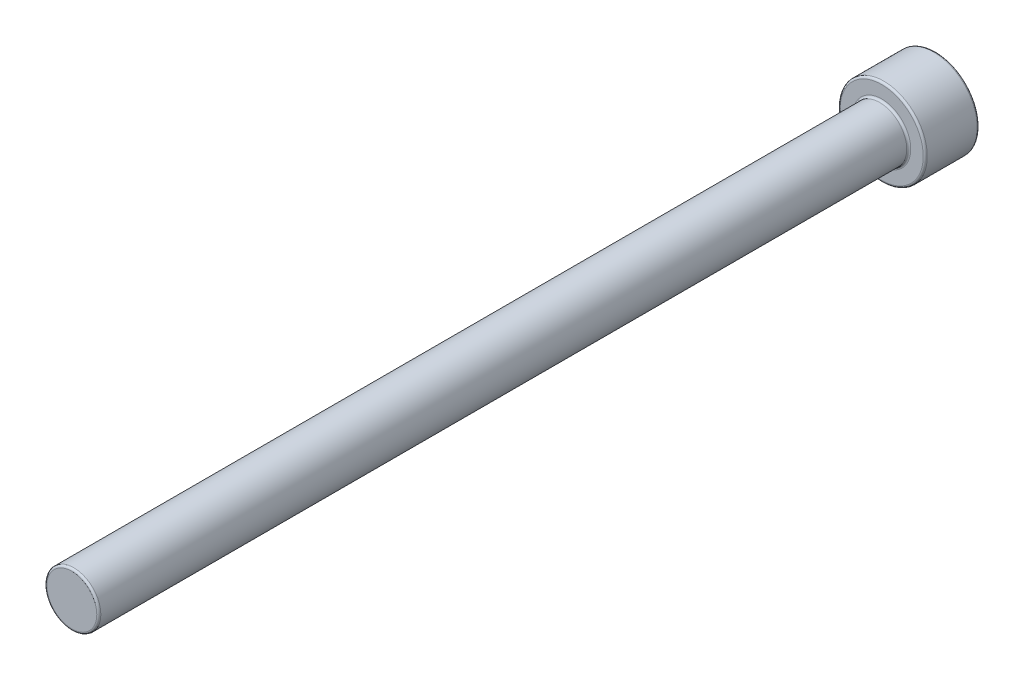
ISO-10303-21;
HEADER;
FILE_DESCRIPTION(('STEP AP214'),'2;1');
FILE_NAME('part.step','',(''),(''),'','','');
FILE_SCHEMA(('AUTOMOTIVE_DESIGN { 1 0 10303 214 1 1 1 1 }'));
ENDSEC;
DATA;
#1=APPLICATION_CONTEXT('core data for automotive mechanical design processes');
#2=APPLICATION_PROTOCOL_DEFINITION('international standard','automotive_design',2000,#1);
#3=PRODUCT_CONTEXT('',#1,'mechanical');
#4=PRODUCT('Part','Part','',(#3));
#5=PRODUCT_RELATED_PRODUCT_CATEGORY('part','',(#4));
#6=PRODUCT_DEFINITION_FORMATION('','',#4);
#7=PRODUCT_DEFINITION_CONTEXT('part definition',#1,'design');
#8=PRODUCT_DEFINITION('design','',#6,#7);
#9=PRODUCT_DEFINITION_SHAPE('','',#8);
#10=(LENGTH_UNIT() NAMED_UNIT(*) SI_UNIT(.MILLI.,.METRE.));
#11=(NAMED_UNIT(*) PLANE_ANGLE_UNIT() SI_UNIT($,.RADIAN.));
#12=(NAMED_UNIT(*) SI_UNIT($,.STERADIAN.) SOLID_ANGLE_UNIT());
#13=UNCERTAINTY_MEASURE_WITH_UNIT(LENGTH_MEASURE(1.E-05),#10,'distance_accuracy_value','');
#14=(GEOMETRIC_REPRESENTATION_CONTEXT(3) GLOBAL_UNCERTAINTY_ASSIGNED_CONTEXT((#13)) GLOBAL_UNIT_ASSIGNED_CONTEXT((#10,
#11,#12)) REPRESENTATION_CONTEXT('',''));
#15=CARTESIAN_POINT('',(0.,0.,0.));
#16=DIRECTION('',(0.,0.,1.));
#17=DIRECTION('',(1.,0.,0.));
#18=AXIS2_PLACEMENT_3D('',#15,#16,#17);
#19=CARTESIAN_POINT('',(0.,0.,120.));
#20=DIRECTION('',(0.,0.,-1.));
#21=DIRECTION('',(-1.,0.,0.));
#22=AXIS2_PLACEMENT_3D('',#19,#20,#21);
#23=CYLINDRICAL_SURFACE('',#22,4.);
#24=CARTESIAN_POINT('',(0.,0.,119.7));
#25=DIRECTION('',(0.,0.,1.));
#26=DIRECTION('',(1.,0.,0.));
#27=AXIS2_PLACEMENT_3D('',#24,#25,#26);
#28=CIRCLE('',#27,4.);
#29=CARTESIAN_POINT('',(4.,0.,119.7));
#30=VERTEX_POINT('',#29);
#31=EDGE_CURVE('E250',#30,#30,#28,.F.);
#32=ORIENTED_EDGE('',*,*,#31,.T.);
#33=EDGE_LOOP('',(#32));
#34=FACE_BOUND('',#33,.T.);
#35=CARTESIAN_POINT('',(0.,0.,0.299999999999995));
#36=DIRECTION('',(0.,0.,-1.));
#37=DIRECTION('',(-1.,0.,0.));
#38=AXIS2_PLACEMENT_3D('',#35,#36,#37);
#39=CIRCLE('',#38,4.);
#40=CARTESIAN_POINT('',(-4.,0.,0.299999999999995));
#41=VERTEX_POINT('',#40);
#42=EDGE_CURVE('E246',#41,#41,#39,.F.);
#43=ORIENTED_EDGE('',*,*,#42,.T.);
#44=EDGE_LOOP('',(#43));
#45=FACE_BOUND('',#44,.T.);
#46=ADVANCED_FACE('F35',(#34,#45),#23,.T.);
#47=CARTESIAN_POINT('',(0.,0.,120.));
#48=DIRECTION('',(0.,0.,1.));
#49=DIRECTION('',(1.,0.,0.));
#50=AXIS2_PLACEMENT_3D('',#47,#48,#49);
#51=PLANE('',#50);
#52=CARTESIAN_POINT('',(0.,0.,120.));
#53=DIRECTION('',(0.,0.,1.));
#54=DIRECTION('',(1.,0.,0.));
#55=AXIS2_PLACEMENT_3D('',#52,#53,#54);
#56=CIRCLE('',#55,3.7);
#57=CARTESIAN_POINT('',(3.7,0.,120.));
#58=VERTEX_POINT('',#57);
#59=EDGE_CURVE('E243',#58,#58,#56,.T.);
#60=ORIENTED_EDGE('',*,*,#59,.T.);
#61=EDGE_LOOP('',(#60));
#62=FACE_BOUND('',#61,.T.);
#63=ADVANCED_FACE('F325',(#62),#51,.T.);
#64=CARTESIAN_POINT('',(0.,0.,-8.));
#65=DIRECTION('',(0.,0.,1.));
#66=DIRECTION('',(1.,0.,0.));
#67=AXIS2_PLACEMENT_3D('',#64,#65,#66);
#68=CYLINDRICAL_SURFACE('',#67,6.45);
#69=CARTESIAN_POINT('',(0.,0.,-0.3));
#70=DIRECTION('',(0.,0.,-1.));
#71=DIRECTION('',(-1.,0.,0.));
#72=AXIS2_PLACEMENT_3D('',#69,#70,#71);
#73=CIRCLE('',#72,6.45);
#74=CARTESIAN_POINT('',(-6.45,0.,-0.3));
#75=VERTEX_POINT('',#74);
#76=EDGE_CURVE('E256',#75,#75,#73,.T.);
#77=ORIENTED_EDGE('',*,*,#76,.T.);
#78=EDGE_LOOP('',(#77));
#79=FACE_BOUND('',#78,.T.);
#80=CARTESIAN_POINT('',(0.,0.,-7.7));
#81=DIRECTION('',(0.,0.,-1.));
#82=DIRECTION('',(-1.,0.,0.));
#83=AXIS2_PLACEMENT_3D('',#80,#81,#82);
#84=CIRCLE('',#83,6.45);
#85=CARTESIAN_POINT('',(-6.45,0.,-7.7));
#86=VERTEX_POINT('',#85);
#87=EDGE_CURVE('E253',#86,#86,#84,.F.);
#88=ORIENTED_EDGE('',*,*,#87,.T.);
#89=EDGE_LOOP('',(#88));
#90=FACE_BOUND('',#89,.T.);
#91=ADVANCED_FACE('F331',(#79,#90),#68,.T.);
#92=CARTESIAN_POINT('',(0.,0.,-8.));
#93=DIRECTION('',(0.,0.,-1.));
#94=DIRECTION('',(-1.,0.,0.));
#95=AXIS2_PLACEMENT_3D('',#92,#93,#94);
#96=PLANE('',#95);
#97=CARTESIAN_POINT('',(0.,0.,-8.));
#98=DIRECTION('',(0.,0.,-1.));
#99=DIRECTION('',(-1.,0.,0.));
#100=AXIS2_PLACEMENT_3D('',#97,#98,#99);
#101=CIRCLE('',#100,6.15);
#102=CARTESIAN_POINT('',(-6.15,0.,-8.));
#103=VERTEX_POINT('',#102);
#104=EDGE_CURVE('E151',#103,#103,#101,.T.);
#105=ORIENTED_EDGE('',*,*,#104,.T.);
#106=EDGE_LOOP('',(#105));
#107=FACE_BOUND('',#106,.T.);
#108=DIRECTION('',(-1.,0.,0.));
#109=VECTOR('',#108,1.);
#110=CARTESIAN_POINT('',(1.73205080756888,-3.3,-8.));
#111=LINE('',#110,#109);
#112=CARTESIAN_POINT('',(-1.90525588832576,-3.3,-8.));
#113=VERTEX_POINT('',#112);
#114=CARTESIAN_POINT('',(1.90525588832577,-3.3,-8.));
#115=VERTEX_POINT('',#114);
#116=EDGE_CURVE('E150',#113,#115,#111,.F.);
#117=ORIENTED_EDGE('',*,*,#116,.T.);
#118=DIRECTION('',(-0.5,-0.866025403784439,0.));
#119=VECTOR('',#118,1.);
#120=CARTESIAN_POINT('',(3.72390923627309,-0.15,-8.));
#121=LINE('',#120,#119);
#122=CARTESIAN_POINT('',(3.81051177665153,0.,-8.));
#123=VERTEX_POINT('',#122);
#124=EDGE_CURVE('E129',#115,#123,#121,.F.);
#125=ORIENTED_EDGE('',*,*,#124,.T.);
#126=DIRECTION('',(0.5,-0.866025403784439,0.));
#127=VECTOR('',#126,1.);
#128=CARTESIAN_POINT('',(1.99185842870421,3.15,-8.));
#129=LINE('',#128,#127);
#130=CARTESIAN_POINT('',(1.90525588832576,3.3,-8.));
#131=VERTEX_POINT('',#130);
#132=EDGE_CURVE('E139',#123,#131,#129,.F.);
#133=ORIENTED_EDGE('',*,*,#132,.T.);
#134=DIRECTION('',(1.,0.,0.));
#135=VECTOR('',#134,1.);
#136=CARTESIAN_POINT('',(-1.73205080756887,3.3,-8.));
#137=LINE('',#136,#135);
#138=CARTESIAN_POINT('',(-1.90525588832576,3.3,-8.));
#139=VERTEX_POINT('',#138);
#140=EDGE_CURVE('E145',#131,#139,#137,.F.);
#141=ORIENTED_EDGE('',*,*,#140,.T.);
#142=DIRECTION('',(0.5,0.866025403784439,0.));
#143=VECTOR('',#142,1.);
#144=CARTESIAN_POINT('',(-3.72390923627308,0.150000000000001,-8.));
#145=LINE('',#144,#143);
#146=CARTESIAN_POINT('',(-3.81051177665153,0.,-8.));
#147=VERTEX_POINT('',#146);
#148=EDGE_CURVE('E265',#139,#147,#145,.F.);
#149=ORIENTED_EDGE('',*,*,#148,.T.);
#150=DIRECTION('',(-0.5,0.866025403784439,0.));
#151=VECTOR('',#150,1.);
#152=CARTESIAN_POINT('',(-1.99185842870421,-3.15,-8.));
#153=LINE('',#152,#151);
#154=EDGE_CURVE('E156',#147,#113,#153,.F.);
#155=ORIENTED_EDGE('',*,*,#154,.T.);
#156=EDGE_LOOP('',(#117,#125,#133,#141,#149,#155));
#157=FACE_BOUND('',#156,.T.);
#158=ADVANCED_FACE('F148',(#107,#157),#96,.T.);
#159=CARTESIAN_POINT('',(0.,0.,0.));
#160=DIRECTION('',(0.,0.,-1.));
#161=DIRECTION('',(-1.,0.,0.));
#162=AXIS2_PLACEMENT_3D('',#159,#160,#161);
#163=PLANE('',#162);
#164=CARTESIAN_POINT('',(0.,0.,0.));
#165=DIRECTION('',(0.,0.,-1.));
#166=DIRECTION('',(-1.,0.,0.));
#167=AXIS2_PLACEMENT_3D('',#164,#165,#166);
#168=CIRCLE('',#167,6.15);
#169=CARTESIAN_POINT('',(-6.15,0.,0.));
#170=VERTEX_POINT('',#169);
#171=EDGE_CURVE('E146',#170,#170,#168,.F.);
#172=ORIENTED_EDGE('',*,*,#171,.T.);
#173=EDGE_LOOP('',(#172));
#174=FACE_BOUND('',#173,.T.);
#175=CARTESIAN_POINT('',(0.,0.,0.));
#176=DIRECTION('',(0.,0.,-1.));
#177=DIRECTION('',(-1.,0.,0.));
#178=AXIS2_PLACEMENT_3D('',#175,#176,#177);
#179=CIRCLE('',#178,4.3);
#180=CARTESIAN_POINT('',(-4.3,0.,0.));
#181=VERTEX_POINT('',#180);
#182=EDGE_CURVE('E259',#181,#181,#179,.T.);
#183=ORIENTED_EDGE('',*,*,#182,.T.);
#184=EDGE_LOOP('',(#183));
#185=FACE_BOUND('',#184,.T.);
#186=ADVANCED_FACE('F466',(#174,#185),#163,.F.);
#187=CARTESIAN_POINT('',(1.73205080756888,3.,-3.));
#188=DIRECTION('',(0.866025403784439,0.5,0.));
#189=DIRECTION('',(-0.5,0.866025403784439,0.));
#190=AXIS2_PLACEMENT_3D('',#187,#188,#189);
#191=PLANE('',#190);
#192=DIRECTION('',(0.,0.,-1.));
#193=VECTOR('',#192,1.);
#194=CARTESIAN_POINT('',(1.73205080756888,3.,-3.));
#195=LINE('',#194,#193);
#196=CARTESIAN_POINT('',(1.73205080756888,3.,-3.3));
#197=VERTEX_POINT('',#196);
#198=CARTESIAN_POINT('',(1.73205080756888,3.,-7.7));
#199=VERTEX_POINT('',#198);
#200=EDGE_CURVE('E247',#197,#199,#195,.T.);
#201=ORIENTED_EDGE('',*,*,#200,.T.);
#202=DIRECTION('',(0.5,-0.866025403784439,0.));
#203=VECTOR('',#202,1.);
#204=CARTESIAN_POINT('',(3.46410161513775,0.,-7.7));
#205=LINE('',#204,#203);
#206=CARTESIAN_POINT('',(3.46410161513775,0.,-7.7));
#207=VERTEX_POINT('',#206);
#208=EDGE_CURVE('E181',#199,#207,#205,.T.);
#209=ORIENTED_EDGE('',*,*,#208,.T.);
#210=DIRECTION('',(0.,0.,-1.));
#211=VECTOR('',#210,1.);
#212=CARTESIAN_POINT('',(3.46410161513775,0.,-3.));
#213=LINE('',#212,#211);
#214=CARTESIAN_POINT('',(3.46410161513775,0.,-3.3));
#215=VERTEX_POINT('',#214);
#216=EDGE_CURVE('E201',#215,#207,#213,.T.);
#217=ORIENTED_EDGE('',*,*,#216,.F.);
#218=DIRECTION('',(0.5,-0.866025403784439,0.));
#219=VECTOR('',#218,1.);
#220=CARTESIAN_POINT('',(1.73205080756888,3.,-3.3));
#221=LINE('',#220,#219);
#222=EDGE_CURVE('E179',#215,#197,#221,.F.);
#223=ORIENTED_EDGE('',*,*,#222,.T.);
#224=EDGE_LOOP('',(#201,#209,#217,#223));
#225=FACE_BOUND('',#224,.T.);
#226=ADVANCED_FACE('F289',(#225),#191,.F.);
#227=CARTESIAN_POINT('',(-1.73205080756887,3.,-3.));
#228=DIRECTION('',(0.,1.,0.));
#229=DIRECTION('',(-1.,0.,0.));
#230=AXIS2_PLACEMENT_3D('',#227,#228,#229);
#231=PLANE('',#230);
#232=DIRECTION('',(0.,0.,-1.));
#233=VECTOR('',#232,1.);
#234=CARTESIAN_POINT('',(-1.73205080756887,3.,-3.));
#235=LINE('',#234,#233);
#236=CARTESIAN_POINT('',(-1.73205080756887,3.,-3.3));
#237=VERTEX_POINT('',#236);
#238=CARTESIAN_POINT('',(-1.73205080756887,3.,-7.7));
#239=VERTEX_POINT('',#238);
#240=EDGE_CURVE('E282',#237,#239,#235,.T.);
#241=ORIENTED_EDGE('',*,*,#240,.T.);
#242=DIRECTION('',(1.,0.,0.));
#243=VECTOR('',#242,1.);
#244=CARTESIAN_POINT('',(1.73205080756888,3.,-7.7));
#245=LINE('',#244,#243);
#246=EDGE_CURVE('E177',#239,#199,#245,.T.);
#247=ORIENTED_EDGE('',*,*,#246,.T.);
#248=ORIENTED_EDGE('',*,*,#200,.F.);
#249=DIRECTION('',(1.,0.,0.));
#250=VECTOR('',#249,1.);
#251=CARTESIAN_POINT('',(-1.73205080756887,3.,-3.3));
#252=LINE('',#251,#250);
#253=EDGE_CURVE('E174',#197,#237,#252,.F.);
#254=ORIENTED_EDGE('',*,*,#253,.T.);
#255=EDGE_LOOP('',(#241,#247,#248,#254));
#256=FACE_BOUND('',#255,.T.);
#257=ADVANCED_FACE('F301',(#256),#231,.F.);
#258=CARTESIAN_POINT('',(-3.46410161513775,0.,-3.));
#259=DIRECTION('',(-0.866025403784439,0.5,0.));
#260=DIRECTION('',(-0.5,-0.866025403784439,0.));
#261=AXIS2_PLACEMENT_3D('',#258,#259,#260);
#262=PLANE('',#261);
#263=DIRECTION('',(0.,0.,-1.));
#264=VECTOR('',#263,1.);
#265=CARTESIAN_POINT('',(-3.46410161513775,0.,-3.));
#266=LINE('',#265,#264);
#267=CARTESIAN_POINT('',(-3.46410161513775,0.,-3.3));
#268=VERTEX_POINT('',#267);
#269=CARTESIAN_POINT('',(-3.46410161513775,0.,-7.7));
#270=VERTEX_POINT('',#269);
#271=EDGE_CURVE('E238',#268,#270,#266,.T.);
#272=ORIENTED_EDGE('',*,*,#271,.T.);
#273=DIRECTION('',(0.5,0.866025403784439,0.));
#274=VECTOR('',#273,1.);
#275=CARTESIAN_POINT('',(-1.73205080756887,3.,-7.7));
#276=LINE('',#275,#274);
#277=EDGE_CURVE('E172',#270,#239,#276,.T.);
#278=ORIENTED_EDGE('',*,*,#277,.T.);
#279=ORIENTED_EDGE('',*,*,#240,.F.);
#280=DIRECTION('',(0.5,0.866025403784439,0.));
#281=VECTOR('',#280,1.);
#282=CARTESIAN_POINT('',(-3.46410161513775,0.,-3.3));
#283=LINE('',#282,#281);
#284=EDGE_CURVE('E170',#237,#268,#283,.F.);
#285=ORIENTED_EDGE('',*,*,#284,.T.);
#286=EDGE_LOOP('',(#272,#278,#279,#285));
#287=FACE_BOUND('',#286,.T.);
#288=ADVANCED_FACE('F300',(#287),#262,.F.);
#289=CARTESIAN_POINT('',(-1.73205080756887,-3.,-3.));
#290=DIRECTION('',(-0.866025403784439,-0.5,0.));
#291=DIRECTION('',(0.5,-0.866025403784439,0.));
#292=AXIS2_PLACEMENT_3D('',#289,#290,#291);
#293=PLANE('',#292);
#294=DIRECTION('',(0.,0.,-1.));
#295=VECTOR('',#294,1.);
#296=CARTESIAN_POINT('',(-1.73205080756887,-3.,-3.));
#297=LINE('',#296,#295);
#298=CARTESIAN_POINT('',(-1.73205080756887,-3.,-3.3));
#299=VERTEX_POINT('',#298);
#300=CARTESIAN_POINT('',(-1.73205080756887,-3.,-7.7));
#301=VERTEX_POINT('',#300);
#302=EDGE_CURVE('E232',#299,#301,#297,.T.);
#303=ORIENTED_EDGE('',*,*,#302,.T.);
#304=DIRECTION('',(-0.5,0.866025403784439,0.));
#305=VECTOR('',#304,1.);
#306=CARTESIAN_POINT('',(-3.46410161513775,0.,-7.7));
#307=LINE('',#306,#305);
#308=EDGE_CURVE('E168',#301,#270,#307,.T.);
#309=ORIENTED_EDGE('',*,*,#308,.T.);
#310=ORIENTED_EDGE('',*,*,#271,.F.);
#311=DIRECTION('',(-0.5,0.866025403784439,0.));
#312=VECTOR('',#311,1.);
#313=CARTESIAN_POINT('',(-1.73205080756887,-3.,-3.3));
#314=LINE('',#313,#312);
#315=EDGE_CURVE('E166',#268,#299,#314,.F.);
#316=ORIENTED_EDGE('',*,*,#315,.T.);
#317=EDGE_LOOP('',(#303,#309,#310,#316));
#318=FACE_BOUND('',#317,.T.);
#319=ADVANCED_FACE('F277',(#318),#293,.F.);
#320=CARTESIAN_POINT('',(1.73205080756888,-3.,-3.));
#321=DIRECTION('',(0.,-1.,0.));
#322=DIRECTION('',(1.,0.,0.));
#323=AXIS2_PLACEMENT_3D('',#320,#321,#322);
#324=PLANE('',#323);
#325=DIRECTION('',(0.,0.,-1.));
#326=VECTOR('',#325,1.);
#327=CARTESIAN_POINT('',(1.73205080756888,-3.,-3.));
#328=LINE('',#327,#326);
#329=CARTESIAN_POINT('',(1.73205080756888,-3.,-3.3));
#330=VERTEX_POINT('',#329);
#331=CARTESIAN_POINT('',(1.73205080756888,-3.,-7.7));
#332=VERTEX_POINT('',#331);
#333=EDGE_CURVE('E230',#330,#332,#328,.T.);
#334=ORIENTED_EDGE('',*,*,#333,.T.);
#335=DIRECTION('',(-1.,0.,0.));
#336=VECTOR('',#335,1.);
#337=CARTESIAN_POINT('',(-1.73205080756887,-3.,-7.7));
#338=LINE('',#337,#336);
#339=EDGE_CURVE('E164',#332,#301,#338,.T.);
#340=ORIENTED_EDGE('',*,*,#339,.T.);
#341=ORIENTED_EDGE('',*,*,#302,.F.);
#342=DIRECTION('',(-1.,0.,0.));
#343=VECTOR('',#342,1.);
#344=CARTESIAN_POINT('',(1.73205080756888,-3.,-3.3));
#345=LINE('',#344,#343);
#346=EDGE_CURVE('E162',#299,#330,#345,.F.);
#347=ORIENTED_EDGE('',*,*,#346,.T.);
#348=EDGE_LOOP('',(#334,#340,#341,#347));
#349=FACE_BOUND('',#348,.T.);
#350=ADVANCED_FACE('F229',(#349),#324,.F.);
#351=CARTESIAN_POINT('',(3.46410161513775,0.,-3.));
#352=DIRECTION('',(0.866025403784439,-0.5,0.));
#353=DIRECTION('',(0.5,0.866025403784439,0.));
#354=AXIS2_PLACEMENT_3D('',#351,#352,#353);
#355=PLANE('',#354);
#356=ORIENTED_EDGE('',*,*,#216,.T.);
#357=DIRECTION('',(-0.5,-0.866025403784439,0.));
#358=VECTOR('',#357,1.);
#359=CARTESIAN_POINT('',(1.73205080756888,-3.,-7.7));
#360=LINE('',#359,#358);
#361=EDGE_CURVE('E132',#207,#332,#360,.T.);
#362=ORIENTED_EDGE('',*,*,#361,.T.);
#363=ORIENTED_EDGE('',*,*,#333,.F.);
#364=DIRECTION('',(-0.5,-0.866025403784439,0.));
#365=VECTOR('',#364,1.);
#366=CARTESIAN_POINT('',(3.46410161513775,0.,-3.3));
#367=LINE('',#366,#365);
#368=EDGE_CURVE('E154',#330,#215,#367,.F.);
#369=ORIENTED_EDGE('',*,*,#368,.T.);
#370=EDGE_LOOP('',(#356,#362,#363,#369));
#371=FACE_BOUND('',#370,.T.);
#372=ADVANCED_FACE('F235',(#371),#355,.F.);
#373=CARTESIAN_POINT('',(0.,0.,-3.));
#374=DIRECTION('',(0.,0.,-1.));
#375=DIRECTION('',(-1.,0.,0.));
#376=AXIS2_PLACEMENT_3D('',#373,#374,#375);
#377=PLANE('',#376);
#378=DIRECTION('',(0.5,0.866025403784439,0.));
#379=VECTOR('',#378,1.);
#380=CARTESIAN_POINT('',(-2.33826859021798,1.35,-3.));
#381=LINE('',#380,#379);
#382=CARTESIAN_POINT('',(-3.11769145362398,0.,-3.));
#383=VERTEX_POINT('',#382);
#384=CARTESIAN_POINT('',(-1.55884572681199,2.7,-3.));
#385=VERTEX_POINT('',#384);
#386=EDGE_CURVE('E44',#383,#385,#381,.T.);
#387=ORIENTED_EDGE('',*,*,#386,.T.);
#388=DIRECTION('',(1.,0.,0.));
#389=VECTOR('',#388,1.);
#390=CARTESIAN_POINT('',(0.,2.7,-3.));
#391=LINE('',#390,#389);
#392=CARTESIAN_POINT('',(1.55884572681199,2.7,-3.));
#393=VERTEX_POINT('',#392);
#394=EDGE_CURVE('E11',#385,#393,#391,.T.);
#395=ORIENTED_EDGE('',*,*,#394,.T.);
#396=DIRECTION('',(0.5,-0.866025403784439,0.));
#397=VECTOR('',#396,1.);
#398=CARTESIAN_POINT('',(2.33826859021799,1.35,-3.));
#399=LINE('',#398,#397);
#400=CARTESIAN_POINT('',(3.11769145362398,0.,-3.));
#401=VERTEX_POINT('',#400);
#402=EDGE_CURVE('E183',#393,#401,#399,.T.);
#403=ORIENTED_EDGE('',*,*,#402,.T.);
#404=DIRECTION('',(-0.5,-0.866025403784439,0.));
#405=VECTOR('',#404,1.);
#406=CARTESIAN_POINT('',(2.33826859021798,-1.35,-3.));
#407=LINE('',#406,#405);
#408=CARTESIAN_POINT('',(1.55884572681199,-2.7,-3.));
#409=VERTEX_POINT('',#408);
#410=EDGE_CURVE('E185',#401,#409,#407,.T.);
#411=ORIENTED_EDGE('',*,*,#410,.T.);
#412=DIRECTION('',(-1.,0.,0.));
#413=VECTOR('',#412,1.);
#414=CARTESIAN_POINT('',(0.,-2.7,-3.));
#415=LINE('',#414,#413);
#416=CARTESIAN_POINT('',(-1.55884572681199,-2.7,-3.));
#417=VERTEX_POINT('',#416);
#418=EDGE_CURVE('E187',#409,#417,#415,.T.);
#419=ORIENTED_EDGE('',*,*,#418,.T.);
#420=DIRECTION('',(-0.5,0.866025403784439,0.));
#421=VECTOR('',#420,1.);
#422=CARTESIAN_POINT('',(-2.33826859021798,-1.35,-3.));
#423=LINE('',#422,#421);
#424=EDGE_CURVE('E55',#417,#383,#423,.T.);
#425=ORIENTED_EDGE('',*,*,#424,.T.);
#426=EDGE_LOOP('',(#387,#395,#403,#411,#419,#425));
#427=FACE_BOUND('',#426,.T.);
#428=ADVANCED_FACE('F311',(#427),#377,.T.);
#429=CARTESIAN_POINT('',(0.,0.,119.7));
#430=DIRECTION('',(0.,0.,1.));
#431=DIRECTION('',(1.,0.,0.));
#432=AXIS2_PLACEMENT_3D('',#429,#430,#431);
#433=TOROIDAL_SURFACE('',#432,3.7,0.3);
#434=ORIENTED_EDGE('',*,*,#31,.F.);
#435=EDGE_LOOP('',(#434));
#436=FACE_BOUND('',#435,.T.);
#437=ORIENTED_EDGE('',*,*,#59,.F.);
#438=EDGE_LOOP('',(#437));
#439=FACE_BOUND('',#438,.T.);
#440=ADVANCED_FACE('F313',(#436,#439),#433,.T.);
#441=CARTESIAN_POINT('',(0.,0.,-0.3));
#442=DIRECTION('',(0.,0.,-1.));
#443=DIRECTION('',(-1.,0.,0.));
#444=AXIS2_PLACEMENT_3D('',#441,#442,#443);
#445=TOROIDAL_SURFACE('',#444,6.15,0.3);
#446=ORIENTED_EDGE('',*,*,#171,.F.);
#447=EDGE_LOOP('',(#446));
#448=FACE_BOUND('',#447,.T.);
#449=ORIENTED_EDGE('',*,*,#76,.F.);
#450=EDGE_LOOP('',(#449));
#451=FACE_BOUND('',#450,.T.);
#452=ADVANCED_FACE('F319',(#448,#451),#445,.T.);
#453=CARTESIAN_POINT('',(0.,0.,0.299999999999995));
#454=DIRECTION('',(0.,0.,-1.));
#455=DIRECTION('',(-1.,0.,0.));
#456=AXIS2_PLACEMENT_3D('',#453,#454,#455);
#457=TOROIDAL_SURFACE('',#456,4.3,0.3);
#458=ORIENTED_EDGE('',*,*,#182,.F.);
#459=EDGE_LOOP('',(#458));
#460=FACE_BOUND('',#459,.T.);
#461=ORIENTED_EDGE('',*,*,#42,.F.);
#462=EDGE_LOOP('',(#461));
#463=FACE_BOUND('',#462,.T.);
#464=ADVANCED_FACE('F339',(#460,#463),#457,.F.);
#465=CARTESIAN_POINT('',(0.,0.,-7.7));
#466=DIRECTION('',(0.,0.,-1.));
#467=DIRECTION('',(-1.,0.,0.));
#468=AXIS2_PLACEMENT_3D('',#465,#466,#467);
#469=TOROIDAL_SURFACE('',#468,6.15,0.3);
#470=ORIENTED_EDGE('',*,*,#87,.F.);
#471=EDGE_LOOP('',(#470));
#472=FACE_BOUND('',#471,.T.);
#473=ORIENTED_EDGE('',*,*,#104,.F.);
#474=EDGE_LOOP('',(#473));
#475=FACE_BOUND('',#474,.T.);
#476=ADVANCED_FACE('F343',(#472,#475),#469,.T.);
#477=CARTESIAN_POINT('',(-3.72390923627308,0.150000000000001,-7.7));
#478=DIRECTION('',(-0.5,-0.866025403784439,0.));
#479=DIRECTION('',(0.866025403784439,-0.5,0.));
#480=AXIS2_PLACEMENT_3D('',#477,#478,#479);
#481=CYLINDRICAL_SURFACE('',#480,0.3);
#482=CARTESIAN_POINT('',(-3.81051177665153,0.,-7.7));
#483=DIRECTION('',(0.,-1.,0.));
#484=DIRECTION('',(1.,0.,0.));
#485=AXIS2_PLACEMENT_3D('',#482,#483,#484);
#486=ELLIPSE('',#485,0.346410161513775,0.3);
#487=EDGE_CURVE('E195',#147,#270,#486,.T.);
#488=ORIENTED_EDGE('',*,*,#487,.F.);
#489=ORIENTED_EDGE('',*,*,#148,.F.);
#490=CARTESIAN_POINT('',(-1.90525588832576,3.3,-7.7));
#491=DIRECTION('',(-0.866025403784439,-0.5,0.));
#492=DIRECTION('',(0.5,-0.866025403784439,0.));
#493=AXIS2_PLACEMENT_3D('',#490,#491,#492);
#494=ELLIPSE('',#493,0.346410161513775,0.3);
#495=EDGE_CURVE('E198',#239,#139,#494,.F.);
#496=ORIENTED_EDGE('',*,*,#495,.F.);
#497=ORIENTED_EDGE('',*,*,#277,.F.);
#498=EDGE_LOOP('',(#488,#489,#496,#497));
#499=FACE_BOUND('',#498,.T.);
#500=ADVANCED_FACE('F298',(#499),#481,.T.);
#501=CARTESIAN_POINT('',(-1.73205080756887,3.3,-7.7));
#502=DIRECTION('',(-1.,0.,0.));
#503=DIRECTION('',(0.,-1.,0.));
#504=AXIS2_PLACEMENT_3D('',#501,#502,#503);
#505=CYLINDRICAL_SURFACE('',#504,0.3);
#506=ORIENTED_EDGE('',*,*,#495,.T.);
#507=ORIENTED_EDGE('',*,*,#140,.F.);
#508=CARTESIAN_POINT('',(1.90525588832576,3.3,-7.7));
#509=DIRECTION('',(-0.866025403784438,0.5,0.));
#510=DIRECTION('',(-0.5,-0.866025403784439,0.));
#511=AXIS2_PLACEMENT_3D('',#508,#509,#510);
#512=ELLIPSE('',#511,0.346410161513775,0.3);
#513=EDGE_CURVE('E142',#199,#131,#512,.F.);
#514=ORIENTED_EDGE('',*,*,#513,.F.);
#515=ORIENTED_EDGE('',*,*,#246,.F.);
#516=EDGE_LOOP('',(#506,#507,#514,#515));
#517=FACE_BOUND('',#516,.T.);
#518=ADVANCED_FACE('F295',(#517),#505,.T.);
#519=CARTESIAN_POINT('',(-1.99185842870421,-3.15,-7.7));
#520=DIRECTION('',(0.5,-0.866025403784439,0.));
#521=DIRECTION('',(0.866025403784439,0.5,0.));
#522=AXIS2_PLACEMENT_3D('',#519,#520,#521);
#523=CYLINDRICAL_SURFACE('',#522,0.3);
#524=ORIENTED_EDGE('',*,*,#487,.T.);
#525=ORIENTED_EDGE('',*,*,#308,.F.);
#526=CARTESIAN_POINT('',(-1.90525588832576,-3.3,-7.7));
#527=DIRECTION('',(0.866025403784439,-0.5,0.));
#528=DIRECTION('',(0.5,0.866025403784439,0.));
#529=AXIS2_PLACEMENT_3D('',#526,#527,#528);
#530=ELLIPSE('',#529,0.346410161513775,0.3);
#531=EDGE_CURVE('E135',#113,#301,#530,.T.);
#532=ORIENTED_EDGE('',*,*,#531,.F.);
#533=ORIENTED_EDGE('',*,*,#154,.F.);
#534=EDGE_LOOP('',(#524,#525,#532,#533));
#535=FACE_BOUND('',#534,.T.);
#536=ADVANCED_FACE('F272',(#535),#523,.T.);
#537=CARTESIAN_POINT('',(1.99185842870421,3.15,-7.7));
#538=DIRECTION('',(-0.5,0.866025403784439,0.));
#539=DIRECTION('',(-0.866025403784439,-0.5,0.));
#540=AXIS2_PLACEMENT_3D('',#537,#538,#539);
#541=CYLINDRICAL_SURFACE('',#540,0.3);
#542=ORIENTED_EDGE('',*,*,#513,.T.);
#543=ORIENTED_EDGE('',*,*,#132,.F.);
#544=CARTESIAN_POINT('',(3.81051177665153,0.,-7.7));
#545=DIRECTION('',(0.,1.,0.));
#546=DIRECTION('',(1.,0.,0.));
#547=AXIS2_PLACEMENT_3D('',#544,#545,#546);
#548=ELLIPSE('',#547,0.346410161513775,0.3);
#549=EDGE_CURVE('E125',#207,#123,#548,.F.);
#550=ORIENTED_EDGE('',*,*,#549,.F.);
#551=ORIENTED_EDGE('',*,*,#208,.F.);
#552=EDGE_LOOP('',(#542,#543,#550,#551));
#553=FACE_BOUND('',#552,.T.);
#554=ADVANCED_FACE('F140',(#553),#541,.T.);
#555=CARTESIAN_POINT('',(1.73205080756888,-3.3,-7.7));
#556=DIRECTION('',(1.,0.,0.));
#557=DIRECTION('',(0.,1.,0.));
#558=AXIS2_PLACEMENT_3D('',#555,#556,#557);
#559=CYLINDRICAL_SURFACE('',#558,0.3);
#560=ORIENTED_EDGE('',*,*,#531,.T.);
#561=ORIENTED_EDGE('',*,*,#339,.F.);
#562=CARTESIAN_POINT('',(1.90525588832577,-3.3,-7.7));
#563=DIRECTION('',(0.866025403784439,0.5,0.));
#564=DIRECTION('',(-0.5,0.866025403784439,0.));
#565=AXIS2_PLACEMENT_3D('',#562,#563,#564);
#566=ELLIPSE('',#565,0.346410161513775,0.3);
#567=EDGE_CURVE('E136',#115,#332,#566,.T.);
#568=ORIENTED_EDGE('',*,*,#567,.F.);
#569=ORIENTED_EDGE('',*,*,#116,.F.);
#570=EDGE_LOOP('',(#560,#561,#568,#569));
#571=FACE_BOUND('',#570,.T.);
#572=ADVANCED_FACE('F275',(#571),#559,.T.);
#573=CARTESIAN_POINT('',(3.72390923627309,-0.15,-7.7));
#574=DIRECTION('',(0.5,0.866025403784439,0.));
#575=DIRECTION('',(-0.866025403784439,0.5,0.));
#576=AXIS2_PLACEMENT_3D('',#573,#574,#575);
#577=CYLINDRICAL_SURFACE('',#576,0.3);
#578=ORIENTED_EDGE('',*,*,#549,.T.);
#579=ORIENTED_EDGE('',*,*,#124,.F.);
#580=ORIENTED_EDGE('',*,*,#567,.T.);
#581=ORIENTED_EDGE('',*,*,#361,.F.);
#582=EDGE_LOOP('',(#578,#579,#580,#581));
#583=FACE_BOUND('',#582,.T.);
#584=ADVANCED_FACE('F127',(#583),#577,.T.);
#585=CARTESIAN_POINT('',(0.,-2.7,-3.3));
#586=DIRECTION('',(-1.,0.,0.));
#587=DIRECTION('',(0.,-1.,0.));
#588=AXIS2_PLACEMENT_3D('',#585,#586,#587);
#589=CYLINDRICAL_SURFACE('',#588,0.3);
#590=CARTESIAN_POINT('',(1.55884572681199,-2.7,-3.3));
#591=DIRECTION('',(-0.866025403784439,-0.5,0.));
#592=DIRECTION('',(-0.5,0.866025403784439,0.));
#593=AXIS2_PLACEMENT_3D('',#590,#591,#592);
#594=ELLIPSE('',#593,0.346410161513775,0.3);
#595=EDGE_CURVE('E211',#330,#409,#594,.T.);
#596=ORIENTED_EDGE('',*,*,#595,.F.);
#597=ORIENTED_EDGE('',*,*,#346,.F.);
#598=CARTESIAN_POINT('',(-1.55884572681199,-2.7,-3.3));
#599=DIRECTION('',(-0.866025403784439,0.5,0.));
#600=DIRECTION('',(0.5,0.866025403784439,0.));
#601=AXIS2_PLACEMENT_3D('',#598,#599,#600);
#602=ELLIPSE('',#601,0.346410161513775,0.3);
#603=EDGE_CURVE('E39',#417,#299,#602,.F.);
#604=ORIENTED_EDGE('',*,*,#603,.F.);
#605=ORIENTED_EDGE('',*,*,#418,.F.);
#606=EDGE_LOOP('',(#596,#597,#604,#605));
#607=FACE_BOUND('',#606,.T.);
#608=ADVANCED_FACE('F37',(#607),#589,.F.);
#609=CARTESIAN_POINT('',(-2.33826859021798,-1.35,-3.3));
#610=DIRECTION('',(-0.5,0.866025403784439,0.));
#611=DIRECTION('',(-0.866025403784439,-0.5,0.));
#612=AXIS2_PLACEMENT_3D('',#609,#610,#611);
#613=CYLINDRICAL_SURFACE('',#612,0.3);
#614=ORIENTED_EDGE('',*,*,#603,.T.);
#615=ORIENTED_EDGE('',*,*,#315,.F.);
#616=CARTESIAN_POINT('',(-3.11769145362398,0.,-3.3));
#617=DIRECTION('',(0.,1.,0.));
#618=DIRECTION('',(1.,0.,0.));
#619=AXIS2_PLACEMENT_3D('',#616,#617,#618);
#620=ELLIPSE('',#619,0.346410161513775,0.3);
#621=EDGE_CURVE('E209',#383,#268,#620,.F.);
#622=ORIENTED_EDGE('',*,*,#621,.F.);
#623=ORIENTED_EDGE('',*,*,#424,.F.);
#624=EDGE_LOOP('',(#614,#615,#622,#623));
#625=FACE_BOUND('',#624,.T.);
#626=ADVANCED_FACE('F221',(#625),#613,.F.);
#627=CARTESIAN_POINT('',(2.33826859021798,-1.35,-3.3));
#628=DIRECTION('',(-0.5,-0.866025403784439,0.));
#629=DIRECTION('',(0.866025403784439,-0.5,0.));
#630=AXIS2_PLACEMENT_3D('',#627,#628,#629);
#631=CYLINDRICAL_SURFACE('',#630,0.3);
#632=ORIENTED_EDGE('',*,*,#595,.T.);
#633=ORIENTED_EDGE('',*,*,#410,.F.);
#634=CARTESIAN_POINT('',(3.11769145362398,0.,-3.3));
#635=DIRECTION('',(0.,-1.,0.));
#636=DIRECTION('',(-1.,0.,0.));
#637=AXIS2_PLACEMENT_3D('',#634,#635,#636);
#638=ELLIPSE('',#637,0.346410161513775,0.3);
#639=EDGE_CURVE('E206',#215,#401,#638,.T.);
#640=ORIENTED_EDGE('',*,*,#639,.F.);
#641=ORIENTED_EDGE('',*,*,#368,.F.);
#642=EDGE_LOOP('',(#632,#633,#640,#641));
#643=FACE_BOUND('',#642,.T.);
#644=ADVANCED_FACE('F367',(#643),#631,.F.);
#645=CARTESIAN_POINT('',(-2.33826859021798,1.35,-3.3));
#646=DIRECTION('',(0.5,0.866025403784439,0.));
#647=DIRECTION('',(-0.866025403784439,0.5,0.));
#648=AXIS2_PLACEMENT_3D('',#645,#646,#647);
#649=CYLINDRICAL_SURFACE('',#648,0.3);
#650=ORIENTED_EDGE('',*,*,#621,.T.);
#651=ORIENTED_EDGE('',*,*,#284,.F.);
#652=CARTESIAN_POINT('',(-1.55884572681199,2.7,-3.3));
#653=DIRECTION('',(0.866025403784439,0.5,0.));
#654=DIRECTION('',(0.5,-0.866025403784439,0.));
#655=AXIS2_PLACEMENT_3D('',#652,#653,#654);
#656=ELLIPSE('',#655,0.346410161513775,0.3);
#657=EDGE_CURVE('E204',#385,#237,#656,.F.);
#658=ORIENTED_EDGE('',*,*,#657,.F.);
#659=ORIENTED_EDGE('',*,*,#386,.F.);
#660=EDGE_LOOP('',(#650,#651,#658,#659));
#661=FACE_BOUND('',#660,.T.);
#662=ADVANCED_FACE('F364',(#661),#649,.F.);
#663=CARTESIAN_POINT('',(2.33826859021798,1.35,-3.3));
#664=DIRECTION('',(0.5,-0.866025403784439,0.));
#665=DIRECTION('',(0.866025403784439,0.5,0.));
#666=AXIS2_PLACEMENT_3D('',#663,#664,#665);
#667=CYLINDRICAL_SURFACE('',#666,0.3);
#668=ORIENTED_EDGE('',*,*,#639,.T.);
#669=ORIENTED_EDGE('',*,*,#402,.F.);
#670=CARTESIAN_POINT('',(1.55884572681199,2.7,-3.3));
#671=DIRECTION('',(0.866025403784438,-0.5,0.));
#672=DIRECTION('',(0.5,0.866025403784439,0.));
#673=AXIS2_PLACEMENT_3D('',#670,#671,#672);
#674=ELLIPSE('',#673,0.346410161513775,0.3);
#675=EDGE_CURVE('E202',#197,#393,#674,.T.);
#676=ORIENTED_EDGE('',*,*,#675,.F.);
#677=ORIENTED_EDGE('',*,*,#222,.F.);
#678=EDGE_LOOP('',(#668,#669,#676,#677));
#679=FACE_BOUND('',#678,.T.);
#680=ADVANCED_FACE('F309',(#679),#667,.F.);
#681=CARTESIAN_POINT('',(0.,2.7,-3.3));
#682=DIRECTION('',(1.,0.,0.));
#683=DIRECTION('',(0.,1.,0.));
#684=AXIS2_PLACEMENT_3D('',#681,#682,#683);
#685=CYLINDRICAL_SURFACE('',#684,0.3);
#686=ORIENTED_EDGE('',*,*,#657,.T.);
#687=ORIENTED_EDGE('',*,*,#253,.F.);
#688=ORIENTED_EDGE('',*,*,#675,.T.);
#689=ORIENTED_EDGE('',*,*,#394,.F.);
#690=EDGE_LOOP('',(#686,#687,#688,#689));
#691=FACE_BOUND('',#690,.T.);
#692=ADVANCED_FACE('F304',(#691),#685,.F.);
#693=CLOSED_SHELL('',(#46,#63,#91,#158,#186,#226,#257,#288,#319,#350,#372,#428,#440,#452,#464,
#476,#500,#518,#536,#554,#572,#584,#608,#626,#644,#662,#680,#692));
#694=MANIFOLD_SOLID_BREP('B2',#693);
#695=ADVANCED_BREP_SHAPE_REPRESENTATION('',(#18,#694),#14);
#696=SHAPE_DEFINITION_REPRESENTATION(#9,#695);
ENDSEC;
END-ISO-10303-21;
